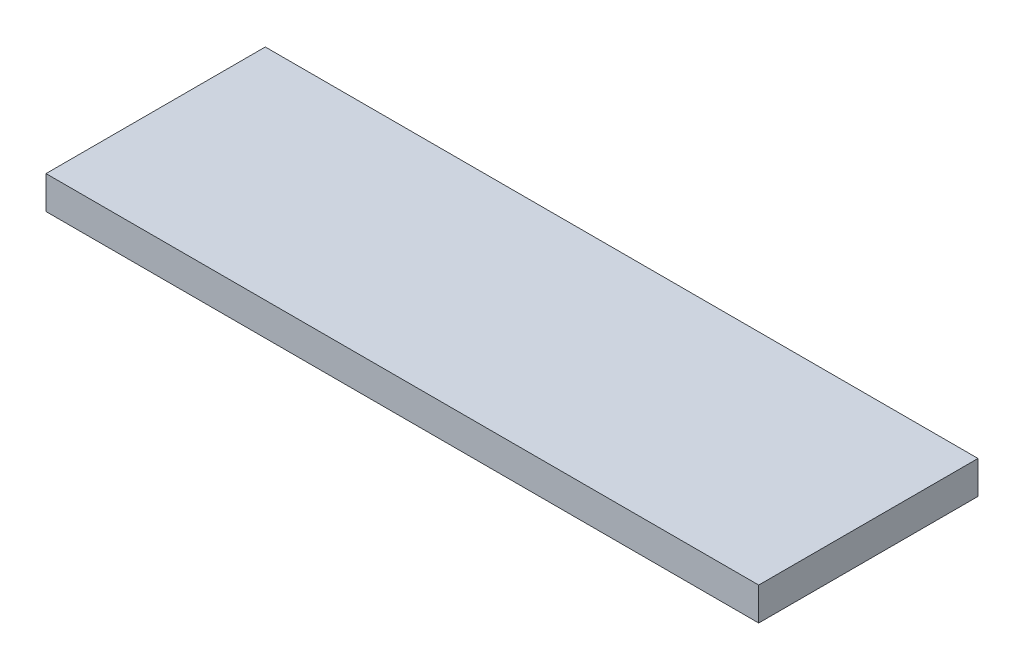
ISO-10303-21;
HEADER;
FILE_DESCRIPTION(('STEP AP214'),'2;1');
FILE_NAME('part.step','',(''),(''),'','','');
FILE_SCHEMA(('AUTOMOTIVE_DESIGN { 1 0 10303 214 1 1 1 1 }'));
ENDSEC;
DATA;
#1=APPLICATION_CONTEXT('core data for automotive mechanical design processes');
#2=APPLICATION_PROTOCOL_DEFINITION('international standard','automotive_design',2000,#1);
#3=PRODUCT_CONTEXT('',#1,'mechanical');
#4=PRODUCT('Part','Part','',(#3));
#5=PRODUCT_RELATED_PRODUCT_CATEGORY('part','',(#4));
#6=PRODUCT_DEFINITION_FORMATION('','',#4);
#7=PRODUCT_DEFINITION_CONTEXT('part definition',#1,'design');
#8=PRODUCT_DEFINITION('design','',#6,#7);
#9=PRODUCT_DEFINITION_SHAPE('','',#8);
#10=(LENGTH_UNIT() NAMED_UNIT(*) SI_UNIT(.MILLI.,.METRE.));
#11=(NAMED_UNIT(*) PLANE_ANGLE_UNIT() SI_UNIT($,.RADIAN.));
#12=(NAMED_UNIT(*) SI_UNIT($,.STERADIAN.) SOLID_ANGLE_UNIT());
#13=UNCERTAINTY_MEASURE_WITH_UNIT(LENGTH_MEASURE(1.E-05),#10,'distance_accuracy_value','');
#14=(GEOMETRIC_REPRESENTATION_CONTEXT(3) GLOBAL_UNCERTAINTY_ASSIGNED_CONTEXT((#13)) GLOBAL_UNIT_ASSIGNED_CONTEXT((#10,
#11,#12)) REPRESENTATION_CONTEXT('',''));
#15=CARTESIAN_POINT('',(0.,0.,0.));
#16=DIRECTION('',(0.,0.,1.));
#17=DIRECTION('',(1.,0.,0.));
#18=AXIS2_PLACEMENT_3D('',#15,#16,#17);
#19=CARTESIAN_POINT('',(32.5,3.,10.));
#20=DIRECTION('',(-1.,0.,0.));
#21=DIRECTION('',(0.,0.,1.));
#22=AXIS2_PLACEMENT_3D('',#19,#20,#21);
#23=PLANE('',#22);
#24=DIRECTION('',(0.,0.,-1.));
#25=VECTOR('',#24,1.);
#26=CARTESIAN_POINT('',(32.5,0.,10.));
#27=LINE('',#26,#25);
#28=CARTESIAN_POINT('',(32.5,0.,10.));
#29=VERTEX_POINT('',#28);
#30=CARTESIAN_POINT('',(32.5,0.,-10.));
#31=VERTEX_POINT('',#30);
#32=EDGE_CURVE('E109',#29,#31,#27,.T.);
#33=ORIENTED_EDGE('',*,*,#32,.T.);
#34=DIRECTION('',(0.,-1.,0.));
#35=VECTOR('',#34,1.);
#36=CARTESIAN_POINT('',(32.5,3.,-10.));
#37=LINE('',#36,#35);
#38=CARTESIAN_POINT('',(32.5,3.,-10.));
#39=VERTEX_POINT('',#38);
#40=EDGE_CURVE('E11',#39,#31,#37,.T.);
#41=ORIENTED_EDGE('',*,*,#40,.F.);
#42=DIRECTION('',(0.,0.,-1.));
#43=VECTOR('',#42,1.);
#44=CARTESIAN_POINT('',(32.5,3.,10.));
#45=LINE('',#44,#43);
#46=CARTESIAN_POINT('',(32.5,3.,10.));
#47=VERTEX_POINT('',#46);
#48=EDGE_CURVE('E94',#47,#39,#45,.T.);
#49=ORIENTED_EDGE('',*,*,#48,.F.);
#50=DIRECTION('',(0.,-1.,0.));
#51=VECTOR('',#50,1.);
#52=CARTESIAN_POINT('',(32.5,3.,10.));
#53=LINE('',#52,#51);
#54=EDGE_CURVE('E105',#47,#29,#53,.T.);
#55=ORIENTED_EDGE('',*,*,#54,.T.);
#56=EDGE_LOOP('',(#33,#41,#49,#55));
#57=FACE_BOUND('',#56,.T.);
#58=ADVANCED_FACE('F40',(#57),#23,.F.);
#59=CARTESIAN_POINT('',(-32.5,3.,-10.));
#60=DIRECTION('',(0.,0.,1.));
#61=DIRECTION('',(1.,0.,0.));
#62=AXIS2_PLACEMENT_3D('',#59,#60,#61);
#63=PLANE('',#62);
#64=DIRECTION('',(-1.,0.,0.));
#65=VECTOR('',#64,1.);
#66=CARTESIAN_POINT('',(-32.5,0.,-10.));
#67=LINE('',#66,#65);
#68=CARTESIAN_POINT('',(-32.5,0.,-10.));
#69=VERTEX_POINT('',#68);
#70=EDGE_CURVE('E99',#31,#69,#67,.T.);
#71=ORIENTED_EDGE('',*,*,#70,.T.);
#72=DIRECTION('',(0.,-1.,0.));
#73=VECTOR('',#72,1.);
#74=CARTESIAN_POINT('',(-32.5,3.,-10.));
#75=LINE('',#74,#73);
#76=CARTESIAN_POINT('',(-32.5,3.,-10.));
#77=VERTEX_POINT('',#76);
#78=EDGE_CURVE('E48',#77,#69,#75,.T.);
#79=ORIENTED_EDGE('',*,*,#78,.F.);
#80=DIRECTION('',(-1.,0.,0.));
#81=VECTOR('',#80,1.);
#82=CARTESIAN_POINT('',(-32.5,3.,-10.));
#83=LINE('',#82,#81);
#84=EDGE_CURVE('E89',#39,#77,#83,.T.);
#85=ORIENTED_EDGE('',*,*,#84,.F.);
#86=ORIENTED_EDGE('',*,*,#40,.T.);
#87=EDGE_LOOP('',(#71,#79,#85,#86));
#88=FACE_BOUND('',#87,.T.);
#89=ADVANCED_FACE('F98',(#88),#63,.F.);
#90=CARTESIAN_POINT('',(-32.5,3.,10.));
#91=DIRECTION('',(1.,0.,0.));
#92=DIRECTION('',(0.,0.,-1.));
#93=AXIS2_PLACEMENT_3D('',#90,#91,#92);
#94=PLANE('',#93);
#95=DIRECTION('',(0.,0.,1.));
#96=VECTOR('',#95,1.);
#97=CARTESIAN_POINT('',(-32.5,0.,10.));
#98=LINE('',#97,#96);
#99=CARTESIAN_POINT('',(-32.5,0.,10.));
#100=VERTEX_POINT('',#99);
#101=EDGE_CURVE('E76',#69,#100,#98,.T.);
#102=ORIENTED_EDGE('',*,*,#101,.T.);
#103=DIRECTION('',(0.,-1.,0.));
#104=VECTOR('',#103,1.);
#105=CARTESIAN_POINT('',(-32.5,3.,10.));
#106=LINE('',#105,#104);
#107=CARTESIAN_POINT('',(-32.5,3.,10.));
#108=VERTEX_POINT('',#107);
#109=EDGE_CURVE('E101',#108,#100,#106,.T.);
#110=ORIENTED_EDGE('',*,*,#109,.F.);
#111=DIRECTION('',(0.,0.,1.));
#112=VECTOR('',#111,1.);
#113=CARTESIAN_POINT('',(-32.5,3.,10.));
#114=LINE('',#113,#112);
#115=EDGE_CURVE('E92',#77,#108,#114,.T.);
#116=ORIENTED_EDGE('',*,*,#115,.F.);
#117=ORIENTED_EDGE('',*,*,#78,.T.);
#118=EDGE_LOOP('',(#102,#110,#116,#117));
#119=FACE_BOUND('',#118,.T.);
#120=ADVANCED_FACE('F102',(#119),#94,.F.);
#121=CARTESIAN_POINT('',(-32.5,3.,10.));
#122=DIRECTION('',(0.,0.,-1.));
#123=DIRECTION('',(-1.,0.,0.));
#124=AXIS2_PLACEMENT_3D('',#121,#122,#123);
#125=PLANE('',#124);
#126=DIRECTION('',(1.,0.,0.));
#127=VECTOR('',#126,1.);
#128=CARTESIAN_POINT('',(-32.5,0.,10.));
#129=LINE('',#128,#127);
#130=EDGE_CURVE('E82',#100,#29,#129,.T.);
#131=ORIENTED_EDGE('',*,*,#130,.T.);
#132=ORIENTED_EDGE('',*,*,#54,.F.);
#133=DIRECTION('',(1.,0.,0.));
#134=VECTOR('',#133,1.);
#135=CARTESIAN_POINT('',(-32.5,3.,10.));
#136=LINE('',#135,#134);
#137=EDGE_CURVE('E59',#108,#47,#136,.T.);
#138=ORIENTED_EDGE('',*,*,#137,.F.);
#139=ORIENTED_EDGE('',*,*,#109,.T.);
#140=EDGE_LOOP('',(#131,#132,#138,#139));
#141=FACE_BOUND('',#140,.T.);
#142=ADVANCED_FACE('F121',(#141),#125,.F.);
#143=CARTESIAN_POINT('',(0.,3.,0.));
#144=DIRECTION('',(0.,-1.,0.));
#145=DIRECTION('',(0.,0.,-1.));
#146=AXIS2_PLACEMENT_3D('',#143,#144,#145);
#147=PLANE('',#146);
#148=ORIENTED_EDGE('',*,*,#48,.T.);
#149=ORIENTED_EDGE('',*,*,#84,.T.);
#150=ORIENTED_EDGE('',*,*,#115,.T.);
#151=ORIENTED_EDGE('',*,*,#137,.T.);
#152=EDGE_LOOP('',(#148,#149,#150,#151));
#153=FACE_BOUND('',#152,.T.);
#154=ADVANCED_FACE('F90',(#153),#147,.F.);
#155=CARTESIAN_POINT('',(0.,0.,0.));
#156=DIRECTION('',(0.,-1.,0.));
#157=DIRECTION('',(0.,0.,-1.));
#158=AXIS2_PLACEMENT_3D('',#155,#156,#157);
#159=PLANE('',#158);
#160=ORIENTED_EDGE('',*,*,#32,.F.);
#161=ORIENTED_EDGE('',*,*,#130,.F.);
#162=ORIENTED_EDGE('',*,*,#101,.F.);
#163=ORIENTED_EDGE('',*,*,#70,.F.);
#164=EDGE_LOOP('',(#160,#161,#162,#163));
#165=FACE_BOUND('',#164,.T.);
#166=ADVANCED_FACE('F124',(#165),#159,.T.);
#167=CLOSED_SHELL('',(#58,#89,#120,#142,#154,#166));
#168=MANIFOLD_SOLID_BREP('B2',#167);
#169=ADVANCED_BREP_SHAPE_REPRESENTATION('',(#18,#168),#14);
#170=SHAPE_DEFINITION_REPRESENTATION(#9,#169);
ENDSEC;
END-ISO-10303-21;
